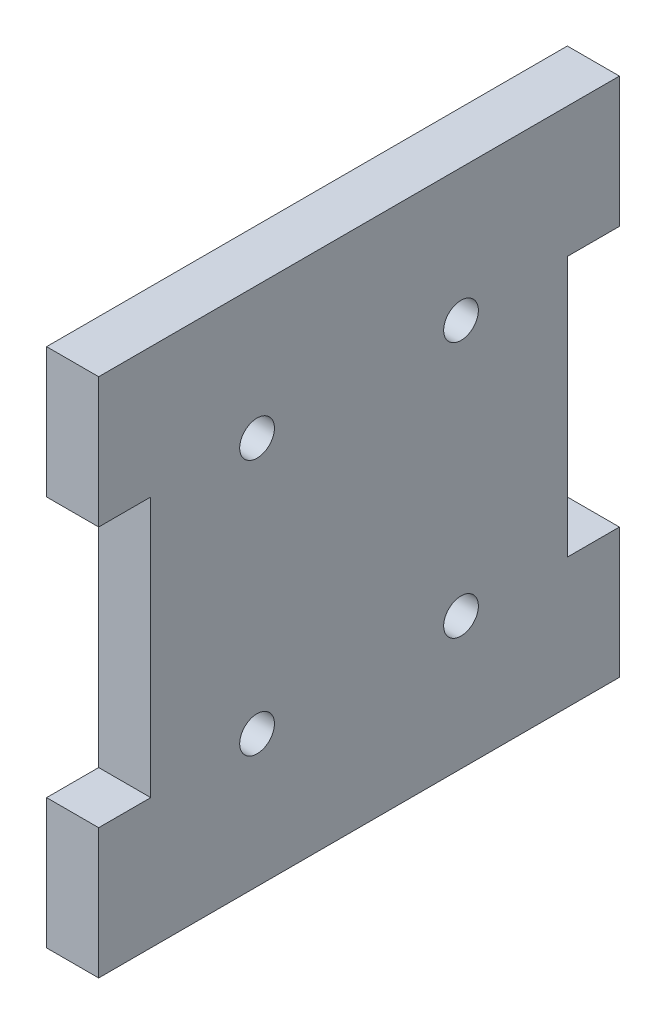
ISO-10303-21;
HEADER;
FILE_DESCRIPTION(('STEP AP214'),'2;1');
FILE_NAME('part.step','',(''),(''),'','','');
FILE_SCHEMA(('AUTOMOTIVE_DESIGN { 1 0 10303 214 1 1 1 1 }'));
ENDSEC;
DATA;
#1=APPLICATION_CONTEXT('core data for automotive mechanical design processes');
#2=APPLICATION_PROTOCOL_DEFINITION('international standard','automotive_design',2000,#1);
#3=PRODUCT_CONTEXT('',#1,'mechanical');
#4=PRODUCT('Part','Part','',(#3));
#5=PRODUCT_RELATED_PRODUCT_CATEGORY('part','',(#4));
#6=PRODUCT_DEFINITION_FORMATION('','',#4);
#7=PRODUCT_DEFINITION_CONTEXT('part definition',#1,'design');
#8=PRODUCT_DEFINITION('design','',#6,#7);
#9=PRODUCT_DEFINITION_SHAPE('','',#8);
#10=(LENGTH_UNIT() NAMED_UNIT(*) SI_UNIT(.MILLI.,.METRE.));
#11=(NAMED_UNIT(*) PLANE_ANGLE_UNIT() SI_UNIT($,.RADIAN.));
#12=(NAMED_UNIT(*) SI_UNIT($,.STERADIAN.) SOLID_ANGLE_UNIT());
#13=UNCERTAINTY_MEASURE_WITH_UNIT(LENGTH_MEASURE(1.E-05),#10,'distance_accuracy_value','');
#14=(GEOMETRIC_REPRESENTATION_CONTEXT(3) GLOBAL_UNCERTAINTY_ASSIGNED_CONTEXT((#13)) GLOBAL_UNIT_ASSIGNED_CONTEXT((#10,
#11,#12)) REPRESENTATION_CONTEXT('',''));
#15=CARTESIAN_POINT('',(0.,0.,0.));
#16=DIRECTION('',(0.,0.,1.));
#17=DIRECTION('',(1.,0.,0.));
#18=AXIS2_PLACEMENT_3D('',#15,#16,#17);
#19=CARTESIAN_POINT('',(6.,0.,0.));
#20=DIRECTION('',(0.,0.,-1.));
#21=DIRECTION('',(0.,1.,0.));
#22=AXIS2_PLACEMENT_3D('',#19,#20,#21);
#23=PLANE('',#22);
#24=DIRECTION('',(0.,-1.,0.));
#25=VECTOR('',#24,1.);
#26=CARTESIAN_POINT('',(0.,0.,0.));
#27=LINE('',#26,#25);
#28=CARTESIAN_POINT('',(0.,0.,0.));
#29=VERTEX_POINT('',#28);
#30=CARTESIAN_POINT('',(0.,-15.,0.));
#31=VERTEX_POINT('',#30);
#32=EDGE_CURVE('E143',#29,#31,#27,.T.);
#33=ORIENTED_EDGE('',*,*,#32,.T.);
#34=DIRECTION('',(1.,0.,0.));
#35=VECTOR('',#34,1.);
#36=CARTESIAN_POINT('',(0.,-15.,0.));
#37=LINE('',#36,#35);
#38=CARTESIAN_POINT('',(6.,-15.,0.));
#39=VERTEX_POINT('',#38);
#40=EDGE_CURVE('E144',#31,#39,#37,.T.);
#41=ORIENTED_EDGE('',*,*,#40,.T.);
#42=DIRECTION('',(0.,-1.,0.));
#43=VECTOR('',#42,1.);
#44=CARTESIAN_POINT('',(6.,0.,0.));
#45=LINE('',#44,#43);
#46=CARTESIAN_POINT('',(6.,0.,0.));
#47=VERTEX_POINT('',#46);
#48=EDGE_CURVE('E204',#47,#39,#45,.T.);
#49=ORIENTED_EDGE('',*,*,#48,.F.);
#50=DIRECTION('',(-1.,0.,0.));
#51=VECTOR('',#50,1.);
#52=CARTESIAN_POINT('',(6.,0.,0.));
#53=LINE('',#52,#51);
#54=EDGE_CURVE('E161',#47,#29,#53,.T.);
#55=ORIENTED_EDGE('',*,*,#54,.T.);
#56=EDGE_LOOP('',(#33,#41,#49,#55));
#57=FACE_BOUND('',#56,.T.);
#58=ADVANCED_FACE('F33',(#57),#23,.F.);
#59=CARTESIAN_POINT('',(6.,0.,-60.));
#60=DIRECTION('',(0.,0.,1.));
#61=DIRECTION('',(0.,-1.,0.));
#62=AXIS2_PLACEMENT_3D('',#59,#60,#61);
#63=PLANE('',#62);
#64=DIRECTION('',(0.,1.,0.));
#65=VECTOR('',#64,1.);
#66=CARTESIAN_POINT('',(0.,0.,-60.));
#67=LINE('',#66,#65);
#68=CARTESIAN_POINT('',(0.,-60.,-60.));
#69=VERTEX_POINT('',#68);
#70=CARTESIAN_POINT('',(0.,-45.,-60.));
#71=VERTEX_POINT('',#70);
#72=EDGE_CURVE('E156',#69,#71,#67,.T.);
#73=ORIENTED_EDGE('',*,*,#72,.T.);
#74=DIRECTION('',(1.,0.,0.));
#75=VECTOR('',#74,1.);
#76=CARTESIAN_POINT('',(0.,-45.,-60.));
#77=LINE('',#76,#75);
#78=CARTESIAN_POINT('',(6.,-45.,-60.));
#79=VERTEX_POINT('',#78);
#80=EDGE_CURVE('E198',#71,#79,#77,.T.);
#81=ORIENTED_EDGE('',*,*,#80,.T.);
#82=DIRECTION('',(0.,1.,0.));
#83=VECTOR('',#82,1.);
#84=CARTESIAN_POINT('',(6.,0.,-60.));
#85=LINE('',#84,#83);
#86=CARTESIAN_POINT('',(6.,-60.,-60.));
#87=VERTEX_POINT('',#86);
#88=EDGE_CURVE('E173',#87,#79,#85,.T.);
#89=ORIENTED_EDGE('',*,*,#88,.F.);
#90=DIRECTION('',(-1.,0.,0.));
#91=VECTOR('',#90,1.);
#92=CARTESIAN_POINT('',(6.,-60.,-60.));
#93=LINE('',#92,#91);
#94=EDGE_CURVE('E41',#87,#69,#93,.T.);
#95=ORIENTED_EDGE('',*,*,#94,.T.);
#96=EDGE_LOOP('',(#73,#81,#89,#95));
#97=FACE_BOUND('',#96,.T.);
#98=ADVANCED_FACE('F170',(#97),#63,.F.);
#99=CARTESIAN_POINT('',(6.,-45.,0.));
#100=VERTEX_POINT('',#99);
#101=CARTESIAN_POINT('',(6.,-60.,0.));
#102=VERTEX_POINT('',#101);
#103=EDGE_CURVE('E137',#100,#102,#45,.T.);
#104=ORIENTED_EDGE('',*,*,#103,.F.);
#105=DIRECTION('',(1.,0.,0.));
#106=VECTOR('',#105,1.);
#107=CARTESIAN_POINT('',(0.,-45.,0.));
#108=LINE('',#107,#106);
#109=CARTESIAN_POINT('',(0.,-45.,0.));
#110=VERTEX_POINT('',#109);
#111=EDGE_CURVE('E125',#110,#100,#108,.T.);
#112=ORIENTED_EDGE('',*,*,#111,.F.);
#113=CARTESIAN_POINT('',(0.,-60.,0.));
#114=VERTEX_POINT('',#113);
#115=EDGE_CURVE('E135',#110,#114,#27,.T.);
#116=ORIENTED_EDGE('',*,*,#115,.T.);
#117=DIRECTION('',(-1.,0.,0.));
#118=VECTOR('',#117,1.);
#119=CARTESIAN_POINT('',(6.,-60.,0.));
#120=LINE('',#119,#118);
#121=EDGE_CURVE('E11',#102,#114,#120,.T.);
#122=ORIENTED_EDGE('',*,*,#121,.F.);
#123=EDGE_LOOP('',(#104,#112,#116,#122));
#124=FACE_BOUND('',#123,.T.);
#125=ADVANCED_FACE('F35',(#124),#23,.F.);
#126=CARTESIAN_POINT('',(6.,-60.,0.));
#127=DIRECTION('',(0.,1.,0.));
#128=DIRECTION('',(0.,0.,1.));
#129=AXIS2_PLACEMENT_3D('',#126,#127,#128);
#130=PLANE('',#129);
#131=DIRECTION('',(0.,0.,-1.));
#132=VECTOR('',#131,1.);
#133=CARTESIAN_POINT('',(0.,-60.,0.));
#134=LINE('',#133,#132);
#135=EDGE_CURVE('E142',#114,#69,#134,.T.);
#136=ORIENTED_EDGE('',*,*,#135,.T.);
#137=ORIENTED_EDGE('',*,*,#94,.F.);
#138=DIRECTION('',(0.,0.,-1.));
#139=VECTOR('',#138,1.);
#140=CARTESIAN_POINT('',(6.,-60.,0.));
#141=LINE('',#140,#139);
#142=EDGE_CURVE('E207',#102,#87,#141,.T.);
#143=ORIENTED_EDGE('',*,*,#142,.F.);
#144=ORIENTED_EDGE('',*,*,#121,.T.);
#145=EDGE_LOOP('',(#136,#137,#143,#144));
#146=FACE_BOUND('',#145,.T.);
#147=ADVANCED_FACE('F259',(#146),#130,.F.);
#148=CARTESIAN_POINT('',(6.,-15.,-60.));
#149=VERTEX_POINT('',#148);
#150=CARTESIAN_POINT('',(6.,0.,-60.));
#151=VERTEX_POINT('',#150);
#152=EDGE_CURVE('E208',#149,#151,#85,.T.);
#153=ORIENTED_EDGE('',*,*,#152,.F.);
#154=DIRECTION('',(1.,0.,0.));
#155=VECTOR('',#154,1.);
#156=CARTESIAN_POINT('',(0.,-15.,-60.));
#157=LINE('',#156,#155);
#158=CARTESIAN_POINT('',(0.,-15.,-60.));
#159=VERTEX_POINT('',#158);
#160=EDGE_CURVE('E181',#159,#149,#157,.T.);
#161=ORIENTED_EDGE('',*,*,#160,.F.);
#162=CARTESIAN_POINT('',(0.,0.,-60.));
#163=VERTEX_POINT('',#162);
#164=EDGE_CURVE('E155',#159,#163,#67,.T.);
#165=ORIENTED_EDGE('',*,*,#164,.T.);
#166=DIRECTION('',(-1.,0.,0.));
#167=VECTOR('',#166,1.);
#168=CARTESIAN_POINT('',(6.,0.,-60.));
#169=LINE('',#168,#167);
#170=EDGE_CURVE('E164',#151,#163,#169,.T.);
#171=ORIENTED_EDGE('',*,*,#170,.F.);
#172=EDGE_LOOP('',(#153,#161,#165,#171));
#173=FACE_BOUND('',#172,.T.);
#174=ADVANCED_FACE('F221',(#173),#63,.F.);
#175=CARTESIAN_POINT('',(6.,0.,0.));
#176=DIRECTION('',(0.,-1.,0.));
#177=DIRECTION('',(0.,0.,-1.));
#178=AXIS2_PLACEMENT_3D('',#175,#176,#177);
#179=PLANE('',#178);
#180=DIRECTION('',(0.,0.,1.));
#181=VECTOR('',#180,1.);
#182=CARTESIAN_POINT('',(0.,0.,0.));
#183=LINE('',#182,#181);
#184=EDGE_CURVE('E159',#163,#29,#183,.T.);
#185=ORIENTED_EDGE('',*,*,#184,.T.);
#186=ORIENTED_EDGE('',*,*,#54,.F.);
#187=DIRECTION('',(0.,0.,1.));
#188=VECTOR('',#187,1.);
#189=CARTESIAN_POINT('',(6.,0.,0.));
#190=LINE('',#189,#188);
#191=EDGE_CURVE('E152',#151,#47,#190,.T.);
#192=ORIENTED_EDGE('',*,*,#191,.F.);
#193=ORIENTED_EDGE('',*,*,#170,.T.);
#194=EDGE_LOOP('',(#185,#186,#192,#193));
#195=FACE_BOUND('',#194,.T.);
#196=ADVANCED_FACE('F225',(#195),#179,.F.);
#197=CARTESIAN_POINT('',(6.,0.,0.));
#198=DIRECTION('',(1.,0.,0.));
#199=DIRECTION('',(0.,0.,-1.));
#200=AXIS2_PLACEMENT_3D('',#197,#198,#199);
#201=PLANE('',#200);
#202=CARTESIAN_POINT('',(6.,-15.25,-18.25));
#203=DIRECTION('',(1.,0.,0.));
#204=DIRECTION('',(0.,0.,-1.));
#205=AXIS2_PLACEMENT_3D('',#202,#203,#204);
#206=CIRCLE('',#205,2.);
#207=CARTESIAN_POINT('',(6.,-15.25,-20.25));
#208=VERTEX_POINT('',#207);
#209=EDGE_CURVE('E309',#208,#208,#206,.T.);
#210=ORIENTED_EDGE('',*,*,#209,.F.);
#211=EDGE_LOOP('',(#210));
#212=FACE_BOUND('',#211,.T.);
#213=CARTESIAN_POINT('',(6.,-44.75,-41.75));
#214=DIRECTION('',(1.,0.,0.));
#215=DIRECTION('',(0.,0.,-1.));
#216=AXIS2_PLACEMENT_3D('',#213,#214,#215);
#217=CIRCLE('',#216,2.);
#218=CARTESIAN_POINT('',(6.,-44.75,-43.75));
#219=VERTEX_POINT('',#218);
#220=EDGE_CURVE('E316',#219,#219,#217,.T.);
#221=ORIENTED_EDGE('',*,*,#220,.F.);
#222=EDGE_LOOP('',(#221));
#223=FACE_BOUND('',#222,.T.);
#224=CARTESIAN_POINT('',(6.,-44.75,-18.25));
#225=DIRECTION('',(1.,0.,0.));
#226=DIRECTION('',(0.,0.,-1.));
#227=AXIS2_PLACEMENT_3D('',#224,#225,#226);
#228=CIRCLE('',#227,2.);
#229=CARTESIAN_POINT('',(6.,-44.75,-20.25));
#230=VERTEX_POINT('',#229);
#231=EDGE_CURVE('E325',#230,#230,#228,.T.);
#232=ORIENTED_EDGE('',*,*,#231,.F.);
#233=EDGE_LOOP('',(#232));
#234=FACE_BOUND('',#233,.T.);
#235=CARTESIAN_POINT('',(6.,-15.25,-41.75));
#236=DIRECTION('',(1.,0.,0.));
#237=DIRECTION('',(0.,0.,-1.));
#238=AXIS2_PLACEMENT_3D('',#235,#236,#237);
#239=CIRCLE('',#238,2.);
#240=CARTESIAN_POINT('',(6.,-15.25,-43.75));
#241=VERTEX_POINT('',#240);
#242=EDGE_CURVE('E303',#241,#241,#239,.T.);
#243=ORIENTED_EDGE('',*,*,#242,.F.);
#244=EDGE_LOOP('',(#243));
#245=FACE_BOUND('',#244,.T.);
#246=DIRECTION('',(0.,0.,1.));
#247=VECTOR('',#246,1.);
#248=CARTESIAN_POINT('',(6.,-15.,0.));
#249=LINE('',#248,#247);
#250=CARTESIAN_POINT('',(6.,-15.,-6.));
#251=VERTEX_POINT('',#250);
#252=EDGE_CURVE('E130',#251,#39,#249,.T.);
#253=ORIENTED_EDGE('',*,*,#252,.F.);
#254=DIRECTION('',(0.,1.,0.));
#255=VECTOR('',#254,1.);
#256=CARTESIAN_POINT('',(6.,-15.,-6.));
#257=LINE('',#256,#255);
#258=CARTESIAN_POINT('',(6.,-45.,-6.));
#259=VERTEX_POINT('',#258);
#260=EDGE_CURVE('E231',#259,#251,#257,.T.);
#261=ORIENTED_EDGE('',*,*,#260,.F.);
#262=DIRECTION('',(0.,0.,-1.));
#263=VECTOR('',#262,1.);
#264=CARTESIAN_POINT('',(6.,-45.,0.));
#265=LINE('',#264,#263);
#266=EDGE_CURVE('E200',#100,#259,#265,.T.);
#267=ORIENTED_EDGE('',*,*,#266,.F.);
#268=ORIENTED_EDGE('',*,*,#103,.T.);
#269=ORIENTED_EDGE('',*,*,#142,.T.);
#270=ORIENTED_EDGE('',*,*,#88,.T.);
#271=DIRECTION('',(0.,0.,-1.));
#272=VECTOR('',#271,1.);
#273=CARTESIAN_POINT('',(6.,-45.,-60.));
#274=LINE('',#273,#272);
#275=CARTESIAN_POINT('',(6.,-45.,-54.));
#276=VERTEX_POINT('',#275);
#277=EDGE_CURVE('E196',#276,#79,#274,.T.);
#278=ORIENTED_EDGE('',*,*,#277,.F.);
#279=DIRECTION('',(0.,-1.,0.));
#280=VECTOR('',#279,1.);
#281=CARTESIAN_POINT('',(6.,-15.,-54.));
#282=LINE('',#281,#280);
#283=CARTESIAN_POINT('',(6.,-15.,-54.));
#284=VERTEX_POINT('',#283);
#285=EDGE_CURVE('E192',#284,#276,#282,.T.);
#286=ORIENTED_EDGE('',*,*,#285,.F.);
#287=DIRECTION('',(0.,0.,1.));
#288=VECTOR('',#287,1.);
#289=CARTESIAN_POINT('',(6.,-15.,-60.));
#290=LINE('',#289,#288);
#291=EDGE_CURVE('E189',#149,#284,#290,.T.);
#292=ORIENTED_EDGE('',*,*,#291,.F.);
#293=ORIENTED_EDGE('',*,*,#152,.T.);
#294=ORIENTED_EDGE('',*,*,#191,.T.);
#295=ORIENTED_EDGE('',*,*,#48,.T.);
#296=EDGE_LOOP('',(#253,#261,#267,#268,#269,#270,#278,#286,#292,#293,#294,#295));
#297=FACE_BOUND('',#296,.T.);
#298=ADVANCED_FACE('F215',(#212,#223,#234,#245,#297),#201,.T.);
#299=CARTESIAN_POINT('',(0.,0.,0.));
#300=DIRECTION('',(1.,0.,0.));
#301=DIRECTION('',(0.,0.,-1.));
#302=AXIS2_PLACEMENT_3D('',#299,#300,#301);
#303=PLANE('',#302);
#304=CARTESIAN_POINT('',(0.,-15.25,-18.25));
#305=DIRECTION('',(1.,0.,0.));
#306=DIRECTION('',(0.,0.,-1.));
#307=AXIS2_PLACEMENT_3D('',#304,#305,#306);
#308=CIRCLE('',#307,2.);
#309=CARTESIAN_POINT('',(0.,-15.25,-20.25));
#310=VERTEX_POINT('',#309);
#311=EDGE_CURVE('E305',#310,#310,#308,.T.);
#312=ORIENTED_EDGE('',*,*,#311,.T.);
#313=EDGE_LOOP('',(#312));
#314=FACE_BOUND('',#313,.T.);
#315=CARTESIAN_POINT('',(0.,-44.75,-41.75));
#316=DIRECTION('',(1.,0.,0.));
#317=DIRECTION('',(0.,0.,-1.));
#318=AXIS2_PLACEMENT_3D('',#315,#316,#317);
#319=CIRCLE('',#318,2.);
#320=CARTESIAN_POINT('',(0.,-44.75,-43.75));
#321=VERTEX_POINT('',#320);
#322=EDGE_CURVE('E319',#321,#321,#319,.T.);
#323=ORIENTED_EDGE('',*,*,#322,.T.);
#324=EDGE_LOOP('',(#323));
#325=FACE_BOUND('',#324,.T.);
#326=CARTESIAN_POINT('',(0.,-44.75,-18.25));
#327=DIRECTION('',(1.,0.,0.));
#328=DIRECTION('',(0.,0.,-1.));
#329=AXIS2_PLACEMENT_3D('',#326,#327,#328);
#330=CIRCLE('',#329,2.);
#331=CARTESIAN_POINT('',(0.,-44.75,-20.25));
#332=VERTEX_POINT('',#331);
#333=EDGE_CURVE('E320',#332,#332,#330,.T.);
#334=ORIENTED_EDGE('',*,*,#333,.T.);
#335=EDGE_LOOP('',(#334));
#336=FACE_BOUND('',#335,.T.);
#337=CARTESIAN_POINT('',(0.,-15.25,-41.75));
#338=DIRECTION('',(1.,0.,0.));
#339=DIRECTION('',(0.,0.,-1.));
#340=AXIS2_PLACEMENT_3D('',#337,#338,#339);
#341=CIRCLE('',#340,2.);
#342=CARTESIAN_POINT('',(0.,-15.25,-43.75));
#343=VERTEX_POINT('',#342);
#344=EDGE_CURVE('E193',#343,#343,#341,.T.);
#345=ORIENTED_EDGE('',*,*,#344,.T.);
#346=EDGE_LOOP('',(#345));
#347=FACE_BOUND('',#346,.T.);
#348=DIRECTION('',(0.,1.,0.));
#349=VECTOR('',#348,1.);
#350=CARTESIAN_POINT('',(0.,-15.,-6.));
#351=LINE('',#350,#349);
#352=CARTESIAN_POINT('',(0.,-45.,-6.));
#353=VERTEX_POINT('',#352);
#354=CARTESIAN_POINT('',(0.,-15.,-6.));
#355=VERTEX_POINT('',#354);
#356=EDGE_CURVE('E48',#353,#355,#351,.T.);
#357=ORIENTED_EDGE('',*,*,#356,.T.);
#358=DIRECTION('',(0.,0.,1.));
#359=VECTOR('',#358,1.);
#360=CARTESIAN_POINT('',(0.,-15.,0.));
#361=LINE('',#360,#359);
#362=EDGE_CURVE('E138',#355,#31,#361,.T.);
#363=ORIENTED_EDGE('',*,*,#362,.T.);
#364=ORIENTED_EDGE('',*,*,#32,.F.);
#365=ORIENTED_EDGE('',*,*,#184,.F.);
#366=ORIENTED_EDGE('',*,*,#164,.F.);
#367=DIRECTION('',(0.,0.,1.));
#368=VECTOR('',#367,1.);
#369=CARTESIAN_POINT('',(0.,-15.,-60.));
#370=LINE('',#369,#368);
#371=CARTESIAN_POINT('',(0.,-15.,-54.));
#372=VERTEX_POINT('',#371);
#373=EDGE_CURVE('E185',#159,#372,#370,.T.);
#374=ORIENTED_EDGE('',*,*,#373,.T.);
#375=DIRECTION('',(0.,-1.,0.));
#376=VECTOR('',#375,1.);
#377=CARTESIAN_POINT('',(0.,-15.,-54.));
#378=LINE('',#377,#376);
#379=CARTESIAN_POINT('',(0.,-45.,-54.));
#380=VERTEX_POINT('',#379);
#381=EDGE_CURVE('E56',#372,#380,#378,.T.);
#382=ORIENTED_EDGE('',*,*,#381,.T.);
#383=DIRECTION('',(0.,0.,-1.));
#384=VECTOR('',#383,1.);
#385=CARTESIAN_POINT('',(0.,-45.,-60.));
#386=LINE('',#385,#384);
#387=EDGE_CURVE('E178',#380,#71,#386,.T.);
#388=ORIENTED_EDGE('',*,*,#387,.T.);
#389=ORIENTED_EDGE('',*,*,#72,.F.);
#390=ORIENTED_EDGE('',*,*,#135,.F.);
#391=ORIENTED_EDGE('',*,*,#115,.F.);
#392=DIRECTION('',(0.,0.,-1.));
#393=VECTOR('',#392,1.);
#394=CARTESIAN_POINT('',(0.,-45.,0.));
#395=LINE('',#394,#393);
#396=EDGE_CURVE('E121',#110,#353,#395,.T.);
#397=ORIENTED_EDGE('',*,*,#396,.T.);
#398=EDGE_LOOP('',(#357,#363,#364,#365,#366,#374,#382,#388,#389,#390,#391,#397));
#399=FACE_BOUND('',#398,.T.);
#400=ADVANCED_FACE('F140',(#314,#325,#336,#347,#399),#303,.F.);
#401=CARTESIAN_POINT('',(0.,-45.,-60.));
#402=DIRECTION('',(0.,-1.,0.));
#403=DIRECTION('',(0.,0.,-1.));
#404=AXIS2_PLACEMENT_3D('',#401,#402,#403);
#405=PLANE('',#404);
#406=ORIENTED_EDGE('',*,*,#277,.T.);
#407=ORIENTED_EDGE('',*,*,#80,.F.);
#408=ORIENTED_EDGE('',*,*,#387,.F.);
#409=DIRECTION('',(1.,0.,0.));
#410=VECTOR('',#409,1.);
#411=CARTESIAN_POINT('',(0.,-45.,-54.));
#412=LINE('',#411,#410);
#413=EDGE_CURVE('E201',#380,#276,#412,.T.);
#414=ORIENTED_EDGE('',*,*,#413,.T.);
#415=EDGE_LOOP('',(#406,#407,#408,#414));
#416=FACE_BOUND('',#415,.T.);
#417=ADVANCED_FACE('F241',(#416),#405,.F.);
#418=CARTESIAN_POINT('',(0.,-15.,-54.));
#419=DIRECTION('',(0.,0.,1.));
#420=DIRECTION('',(0.,-1.,0.));
#421=AXIS2_PLACEMENT_3D('',#418,#419,#420);
#422=PLANE('',#421);
#423=ORIENTED_EDGE('',*,*,#285,.T.);
#424=ORIENTED_EDGE('',*,*,#413,.F.);
#425=ORIENTED_EDGE('',*,*,#381,.F.);
#426=DIRECTION('',(1.,0.,0.));
#427=VECTOR('',#426,1.);
#428=CARTESIAN_POINT('',(0.,-15.,-54.));
#429=LINE('',#428,#427);
#430=EDGE_CURVE('E183',#372,#284,#429,.T.);
#431=ORIENTED_EDGE('',*,*,#430,.T.);
#432=EDGE_LOOP('',(#423,#424,#425,#431));
#433=FACE_BOUND('',#432,.T.);
#434=ADVANCED_FACE('F240',(#433),#422,.F.);
#435=CARTESIAN_POINT('',(0.,-15.,-60.));
#436=DIRECTION('',(0.,1.,0.));
#437=DIRECTION('',(0.,0.,1.));
#438=AXIS2_PLACEMENT_3D('',#435,#436,#437);
#439=PLANE('',#438);
#440=ORIENTED_EDGE('',*,*,#291,.T.);
#441=ORIENTED_EDGE('',*,*,#430,.F.);
#442=ORIENTED_EDGE('',*,*,#373,.F.);
#443=ORIENTED_EDGE('',*,*,#160,.T.);
#444=EDGE_LOOP('',(#440,#441,#442,#443));
#445=FACE_BOUND('',#444,.T.);
#446=ADVANCED_FACE('F239',(#445),#439,.F.);
#447=CARTESIAN_POINT('',(0.,-15.,0.));
#448=DIRECTION('',(0.,1.,0.));
#449=DIRECTION('',(0.,0.,1.));
#450=AXIS2_PLACEMENT_3D('',#447,#448,#449);
#451=PLANE('',#450);
#452=ORIENTED_EDGE('',*,*,#252,.T.);
#453=ORIENTED_EDGE('',*,*,#40,.F.);
#454=ORIENTED_EDGE('',*,*,#362,.F.);
#455=DIRECTION('',(1.,0.,0.));
#456=VECTOR('',#455,1.);
#457=CARTESIAN_POINT('',(0.,-15.,-6.));
#458=LINE('',#457,#456);
#459=EDGE_CURVE('E148',#355,#251,#458,.T.);
#460=ORIENTED_EDGE('',*,*,#459,.T.);
#461=EDGE_LOOP('',(#452,#453,#454,#460));
#462=FACE_BOUND('',#461,.T.);
#463=ADVANCED_FACE('F273',(#462),#451,.F.);
#464=CARTESIAN_POINT('',(0.,-15.,-6.));
#465=DIRECTION('',(0.,0.,-1.));
#466=DIRECTION('',(0.,1.,0.));
#467=AXIS2_PLACEMENT_3D('',#464,#465,#466);
#468=PLANE('',#467);
#469=ORIENTED_EDGE('',*,*,#260,.T.);
#470=ORIENTED_EDGE('',*,*,#459,.F.);
#471=ORIENTED_EDGE('',*,*,#356,.F.);
#472=DIRECTION('',(1.,0.,0.));
#473=VECTOR('',#472,1.);
#474=CARTESIAN_POINT('',(0.,-45.,-6.));
#475=LINE('',#474,#473);
#476=EDGE_CURVE('E127',#353,#259,#475,.T.);
#477=ORIENTED_EDGE('',*,*,#476,.T.);
#478=EDGE_LOOP('',(#469,#470,#471,#477));
#479=FACE_BOUND('',#478,.T.);
#480=ADVANCED_FACE('F277',(#479),#468,.F.);
#481=CARTESIAN_POINT('',(0.,-45.,0.));
#482=DIRECTION('',(0.,-1.,0.));
#483=DIRECTION('',(0.,0.,-1.));
#484=AXIS2_PLACEMENT_3D('',#481,#482,#483);
#485=PLANE('',#484);
#486=ORIENTED_EDGE('',*,*,#266,.T.);
#487=ORIENTED_EDGE('',*,*,#476,.F.);
#488=ORIENTED_EDGE('',*,*,#396,.F.);
#489=ORIENTED_EDGE('',*,*,#111,.T.);
#490=EDGE_LOOP('',(#486,#487,#488,#489));
#491=FACE_BOUND('',#490,.T.);
#492=ADVANCED_FACE('F124',(#491),#485,.F.);
#493=CARTESIAN_POINT('',(0.,-15.25,-41.75));
#494=DIRECTION('',(1.,0.,0.));
#495=DIRECTION('',(0.,0.,-1.));
#496=AXIS2_PLACEMENT_3D('',#493,#494,#495);
#497=CYLINDRICAL_SURFACE('',#496,2.);
#498=ORIENTED_EDGE('',*,*,#344,.F.);
#499=EDGE_LOOP('',(#498));
#500=FACE_BOUND('',#499,.T.);
#501=ORIENTED_EDGE('',*,*,#242,.T.);
#502=EDGE_LOOP('',(#501));
#503=FACE_BOUND('',#502,.T.);
#504=ADVANCED_FACE('F284',(#500,#503),#497,.F.);
#505=CARTESIAN_POINT('',(0.,-44.75,-18.25));
#506=DIRECTION('',(1.,0.,0.));
#507=DIRECTION('',(0.,0.,-1.));
#508=AXIS2_PLACEMENT_3D('',#505,#506,#507);
#509=CYLINDRICAL_SURFACE('',#508,2.);
#510=ORIENTED_EDGE('',*,*,#333,.F.);
#511=EDGE_LOOP('',(#510));
#512=FACE_BOUND('',#511,.T.);
#513=ORIENTED_EDGE('',*,*,#231,.T.);
#514=EDGE_LOOP('',(#513));
#515=FACE_BOUND('',#514,.T.);
#516=ADVANCED_FACE('F290',(#512,#515),#509,.F.);
#517=CARTESIAN_POINT('',(0.,-44.75,-41.75));
#518=DIRECTION('',(1.,0.,0.));
#519=DIRECTION('',(0.,0.,-1.));
#520=AXIS2_PLACEMENT_3D('',#517,#518,#519);
#521=CYLINDRICAL_SURFACE('',#520,2.);
#522=ORIENTED_EDGE('',*,*,#322,.F.);
#523=EDGE_LOOP('',(#522));
#524=FACE_BOUND('',#523,.T.);
#525=ORIENTED_EDGE('',*,*,#220,.T.);
#526=EDGE_LOOP('',(#525));
#527=FACE_BOUND('',#526,.T.);
#528=ADVANCED_FACE('F295',(#524,#527),#521,.F.);
#529=CARTESIAN_POINT('',(0.,-15.25,-18.25));
#530=DIRECTION('',(1.,0.,0.));
#531=DIRECTION('',(0.,0.,-1.));
#532=AXIS2_PLACEMENT_3D('',#529,#530,#531);
#533=CYLINDRICAL_SURFACE('',#532,2.);
#534=ORIENTED_EDGE('',*,*,#311,.F.);
#535=EDGE_LOOP('',(#534));
#536=FACE_BOUND('',#535,.T.);
#537=ORIENTED_EDGE('',*,*,#209,.T.);
#538=EDGE_LOOP('',(#537));
#539=FACE_BOUND('',#538,.T.);
#540=ADVANCED_FACE('F337',(#536,#539),#533,.F.);
#541=CLOSED_SHELL('',(#58,#98,#125,#147,#174,#196,#298,#400,#417,#434,#446,#463,#480,#492,#504,
#516,#528,#540));
#542=MANIFOLD_SOLID_BREP('B2',#541);
#543=ADVANCED_BREP_SHAPE_REPRESENTATION('',(#18,#542),#14);
#544=SHAPE_DEFINITION_REPRESENTATION(#9,#543);
ENDSEC;
END-ISO-10303-21;
